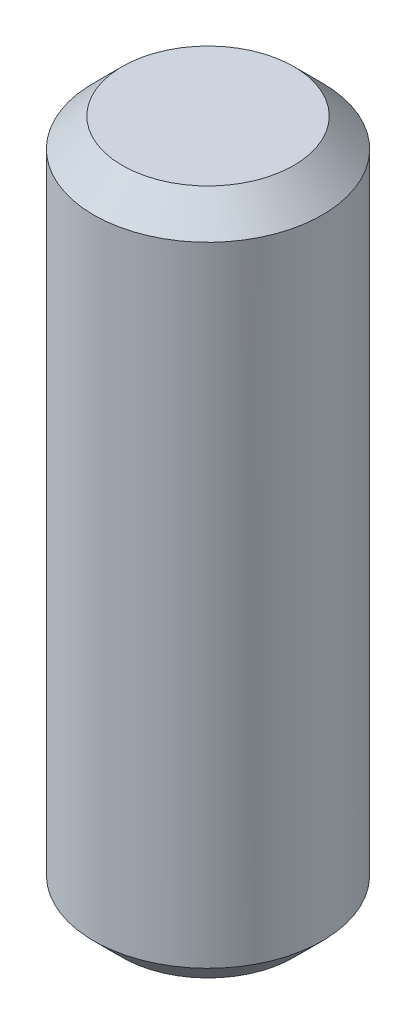
ISO-10303-21;
HEADER;
FILE_DESCRIPTION(('STEP AP214'),'2;1');
FILE_NAME('part.step','',(''),(''),'','','');
FILE_SCHEMA(('AUTOMOTIVE_DESIGN { 1 0 10303 214 1 1 1 1 }'));
ENDSEC;
DATA;
#1=APPLICATION_CONTEXT('core data for automotive mechanical design processes');
#2=APPLICATION_PROTOCOL_DEFINITION('international standard','automotive_design',2000,#1);
#3=PRODUCT_CONTEXT('',#1,'mechanical');
#4=PRODUCT('Part','Part','',(#3));
#5=PRODUCT_RELATED_PRODUCT_CATEGORY('part','',(#4));
#6=PRODUCT_DEFINITION_FORMATION('','',#4);
#7=PRODUCT_DEFINITION_CONTEXT('part definition',#1,'design');
#8=PRODUCT_DEFINITION('design','',#6,#7);
#9=PRODUCT_DEFINITION_SHAPE('','',#8);
#10=(LENGTH_UNIT() NAMED_UNIT(*) SI_UNIT(.MILLI.,.METRE.));
#11=(NAMED_UNIT(*) PLANE_ANGLE_UNIT() SI_UNIT($,.RADIAN.));
#12=(NAMED_UNIT(*) SI_UNIT($,.STERADIAN.) SOLID_ANGLE_UNIT());
#13=UNCERTAINTY_MEASURE_WITH_UNIT(LENGTH_MEASURE(1.E-05),#10,'distance_accuracy_value','');
#14=(GEOMETRIC_REPRESENTATION_CONTEXT(3) GLOBAL_UNCERTAINTY_ASSIGNED_CONTEXT((#13)) GLOBAL_UNIT_ASSIGNED_CONTEXT((#10,
#11,#12)) REPRESENTATION_CONTEXT('',''));
#15=CARTESIAN_POINT('',(0.,0.,0.));
#16=DIRECTION('',(0.,0.,1.));
#17=DIRECTION('',(1.,0.,0.));
#18=AXIS2_PLACEMENT_3D('',#15,#16,#17);
#19=CARTESIAN_POINT('',(0.,24.,0.));
#20=DIRECTION('',(0.,1.,0.));
#21=DIRECTION('',(0.,0.,1.));
#22=AXIS2_PLACEMENT_3D('',#19,#20,#21);
#23=PLANE('',#22);
#24=CARTESIAN_POINT('',(0.,24.,0.));
#25=DIRECTION('',(0.,1.,0.));
#26=DIRECTION('',(0.,0.,1.));
#27=AXIS2_PLACEMENT_3D('',#24,#25,#26);
#28=CIRCLE('',#27,2.99999999999999);
#29=CARTESIAN_POINT('',(0.,24.,2.99999999999999));
#30=VERTEX_POINT('',#29);
#31=EDGE_CURVE('E10',#30,#30,#28,.T.);
#32=ORIENTED_EDGE('',*,*,#31,.T.);
#33=EDGE_LOOP('',(#32));
#34=FACE_BOUND('',#33,.T.);
#35=ADVANCED_FACE('F31',(#34),#23,.T.);
#36=CARTESIAN_POINT('',(0.,0.,0.));
#37=DIRECTION('',(0.,-1.,0.));
#38=DIRECTION('',(0.,0.,-1.));
#39=AXIS2_PLACEMENT_3D('',#36,#37,#38);
#40=CYLINDRICAL_SURFACE('',#39,4.);
#41=CARTESIAN_POINT('',(0.,1.00000000000001,0.));
#42=DIRECTION('',(0.,-1.,0.));
#43=DIRECTION('',(0.,0.,-1.));
#44=AXIS2_PLACEMENT_3D('',#41,#42,#43);
#45=CIRCLE('',#44,4.);
#46=CARTESIAN_POINT('',(0.,1.00000000000001,-4.));
#47=VERTEX_POINT('',#46);
#48=EDGE_CURVE('E38',#47,#47,#45,.F.);
#49=ORIENTED_EDGE('',*,*,#48,.T.);
#50=EDGE_LOOP('',(#49));
#51=FACE_BOUND('',#50,.T.);
#52=CARTESIAN_POINT('',(0.,23.,0.));
#53=DIRECTION('',(0.,1.,0.));
#54=DIRECTION('',(0.,0.,1.));
#55=AXIS2_PLACEMENT_3D('',#52,#53,#54);
#56=CIRCLE('',#55,4.);
#57=CARTESIAN_POINT('',(0.,23.,4.));
#58=VERTEX_POINT('',#57);
#59=EDGE_CURVE('E42',#58,#58,#56,.F.);
#60=ORIENTED_EDGE('',*,*,#59,.T.);
#61=EDGE_LOOP('',(#60));
#62=FACE_BOUND('',#61,.T.);
#63=ADVANCED_FACE('F62',(#51,#62),#40,.T.);
#64=CARTESIAN_POINT('',(0.,0.,0.));
#65=DIRECTION('',(0.,-1.,0.));
#66=DIRECTION('',(0.,0.,-1.));
#67=AXIS2_PLACEMENT_3D('',#64,#65,#66);
#68=PLANE('',#67);
#69=CARTESIAN_POINT('',(0.,0.,0.));
#70=DIRECTION('',(0.,-1.,0.));
#71=DIRECTION('',(0.,0.,-1.));
#72=AXIS2_PLACEMENT_3D('',#69,#70,#71);
#73=CIRCLE('',#72,3.);
#74=CARTESIAN_POINT('',(0.,0.,-3.));
#75=VERTEX_POINT('',#74);
#76=EDGE_CURVE('E46',#75,#75,#73,.T.);
#77=ORIENTED_EDGE('',*,*,#76,.T.);
#78=EDGE_LOOP('',(#77));
#79=FACE_BOUND('',#78,.T.);
#80=ADVANCED_FACE('F52',(#79),#68,.T.);
#81=CARTESIAN_POINT('',(0.,0.,0.));
#82=DIRECTION('',(0.,1.,0.));
#83=DIRECTION('',(0.,0.,1.));
#84=AXIS2_PLACEMENT_3D('',#81,#82,#83);
#85=CONICAL_SURFACE('',#84,3.,0.785398163397447);
#86=ORIENTED_EDGE('',*,*,#48,.F.);
#87=EDGE_LOOP('',(#86));
#88=FACE_BOUND('',#87,.T.);
#89=ORIENTED_EDGE('',*,*,#76,.F.);
#90=EDGE_LOOP('',(#89));
#91=FACE_BOUND('',#90,.T.);
#92=ADVANCED_FACE('F54',(#88,#91),#85,.T.);
#93=CARTESIAN_POINT('',(0.,23.,0.));
#94=DIRECTION('',(0.,-1.,0.));
#95=DIRECTION('',(0.,0.,-1.));
#96=AXIS2_PLACEMENT_3D('',#93,#94,#95);
#97=CONICAL_SURFACE('',#96,4.,0.785398163397448);
#98=ORIENTED_EDGE('',*,*,#31,.F.);
#99=EDGE_LOOP('',(#98));
#100=FACE_BOUND('',#99,.T.);
#101=ORIENTED_EDGE('',*,*,#59,.F.);
#102=EDGE_LOOP('',(#101));
#103=FACE_BOUND('',#102,.T.);
#104=ADVANCED_FACE('F33',(#100,#103),#97,.T.);
#105=CLOSED_SHELL('',(#35,#63,#80,#92,#104));
#106=MANIFOLD_SOLID_BREP('B2',#105);
#107=ADVANCED_BREP_SHAPE_REPRESENTATION('',(#18,#106),#14);
#108=SHAPE_DEFINITION_REPRESENTATION(#9,#107);
ENDSEC;
END-ISO-10303-21;
